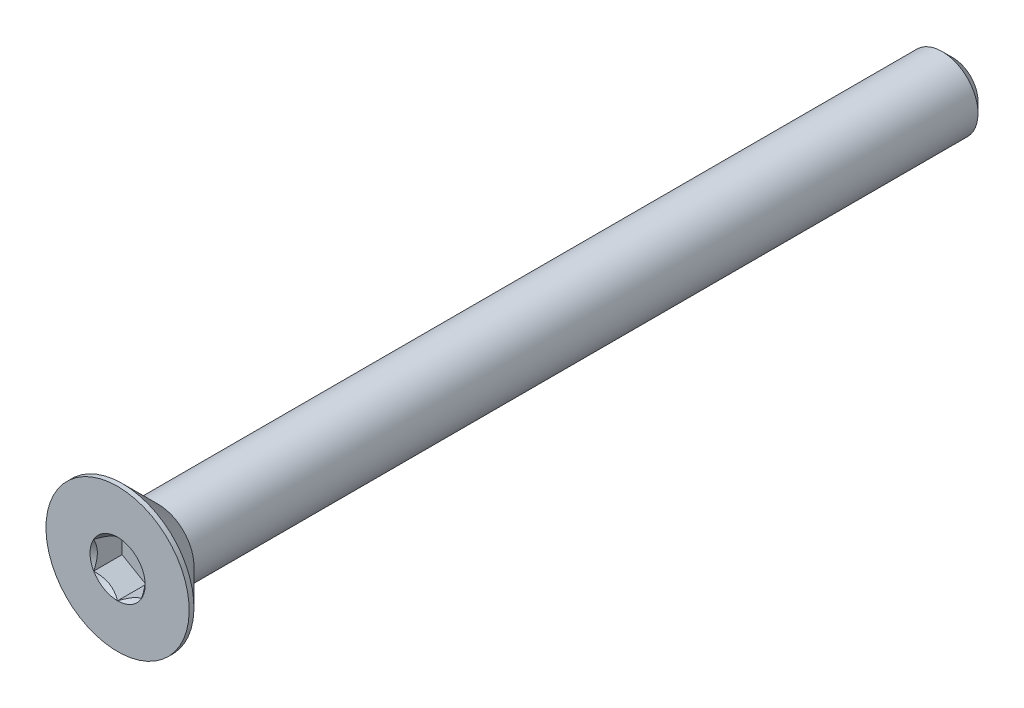
ISO-10303-21;
HEADER;
FILE_DESCRIPTION(('STEP AP214'),'2;1');
FILE_NAME('part.step','',(''),(''),'','','');
FILE_SCHEMA(('AUTOMOTIVE_DESIGN { 1 0 10303 214 1 1 1 1 }'));
ENDSEC;
DATA;
#1=APPLICATION_CONTEXT('core data for automotive mechanical design processes');
#2=APPLICATION_PROTOCOL_DEFINITION('international standard','automotive_design',2000,#1);
#3=PRODUCT_CONTEXT('',#1,'mechanical');
#4=PRODUCT('Part','Part','',(#3));
#5=PRODUCT_RELATED_PRODUCT_CATEGORY('part','',(#4));
#6=PRODUCT_DEFINITION_FORMATION('','',#4);
#7=PRODUCT_DEFINITION_CONTEXT('part definition',#1,'design');
#8=PRODUCT_DEFINITION('design','',#6,#7);
#9=PRODUCT_DEFINITION_SHAPE('','',#8);
#10=(LENGTH_UNIT() NAMED_UNIT(*) SI_UNIT(.MILLI.,.METRE.));
#11=(NAMED_UNIT(*) PLANE_ANGLE_UNIT() SI_UNIT($,.RADIAN.));
#12=(NAMED_UNIT(*) SI_UNIT($,.STERADIAN.) SOLID_ANGLE_UNIT());
#13=UNCERTAINTY_MEASURE_WITH_UNIT(LENGTH_MEASURE(1.E-05),#10,'distance_accuracy_value','');
#14=(GEOMETRIC_REPRESENTATION_CONTEXT(3) GLOBAL_UNCERTAINTY_ASSIGNED_CONTEXT((#13)) GLOBAL_UNIT_ASSIGNED_CONTEXT((#10,
#11,#12)) REPRESENTATION_CONTEXT('',''));
#15=CARTESIAN_POINT('',(0.,0.,0.));
#16=DIRECTION('',(0.,0.,1.));
#17=DIRECTION('',(1.,0.,0.));
#18=AXIS2_PLACEMENT_3D('',#15,#16,#17);
#19=CARTESIAN_POINT('',(0.,0.,-17.5));
#20=DIRECTION('',(0.,0.,-1.));
#21=DIRECTION('',(0.,1.,0.));
#22=AXIS2_PLACEMENT_3D('',#19,#20,#21);
#23=CYLINDRICAL_SURFACE('',#22,1.5);
#24=CARTESIAN_POINT('',(0.,0.,15.8));
#25=DIRECTION('',(0.,0.,-1.));
#26=DIRECTION('',(0.,1.,0.));
#27=AXIS2_PLACEMENT_3D('',#24,#25,#26);
#28=CIRCLE('',#27,1.5);
#29=CARTESIAN_POINT('',(0.,1.5,15.8));
#30=VERTEX_POINT('',#29);
#31=EDGE_CURVE('E11',#30,#30,#28,.F.);
#32=ORIENTED_EDGE('',*,*,#31,.F.);
#33=EDGE_LOOP('',(#32));
#34=FACE_BOUND('',#33,.T.);
#35=CARTESIAN_POINT('',(0.,0.,-17.05));
#36=DIRECTION('',(0.,0.,-1.));
#37=DIRECTION('',(0.,1.,0.));
#38=AXIS2_PLACEMENT_3D('',#35,#36,#37);
#39=CIRCLE('',#38,1.5);
#40=CARTESIAN_POINT('',(0.,1.5,-17.05));
#41=VERTEX_POINT('',#40);
#42=EDGE_CURVE('E50',#41,#41,#39,.F.);
#43=ORIENTED_EDGE('',*,*,#42,.T.);
#44=EDGE_LOOP('',(#43));
#45=FACE_BOUND('',#44,.T.);
#46=ADVANCED_FACE('F41',(#34,#45),#23,.T.);
#47=CARTESIAN_POINT('',(0.,1.5,-17.5));
#48=DIRECTION('',(0.,0.,-1.));
#49=DIRECTION('',(0.,1.,0.));
#50=AXIS2_PLACEMENT_3D('',#47,#48,#49);
#51=PLANE('',#50);
#52=CARTESIAN_POINT('',(0.,0.,-17.5));
#53=DIRECTION('',(0.,0.,-1.));
#54=DIRECTION('',(0.,1.,0.));
#55=AXIS2_PLACEMENT_3D('',#52,#53,#54);
#56=CIRCLE('',#55,1.05000000000001);
#57=CARTESIAN_POINT('',(0.,1.05000000000001,-17.5));
#58=VERTEX_POINT('',#57);
#59=EDGE_CURVE('E166',#58,#58,#56,.T.);
#60=ORIENTED_EDGE('',*,*,#59,.T.);
#61=EDGE_LOOP('',(#60));
#62=FACE_BOUND('',#61,.T.);
#63=ADVANCED_FACE('F177',(#62),#51,.T.);
#64=CARTESIAN_POINT('',(0.,0.,-17.5));
#65=DIRECTION('',(0.,0.,1.));
#66=DIRECTION('',(0.,-1.,0.));
#67=AXIS2_PLACEMENT_3D('',#64,#65,#66);
#68=CONICAL_SURFACE('',#67,1.05000000000001,0.785398163397445);
#69=ORIENTED_EDGE('',*,*,#42,.F.);
#70=EDGE_LOOP('',(#69));
#71=FACE_BOUND('',#70,.T.);
#72=ORIENTED_EDGE('',*,*,#59,.F.);
#73=EDGE_LOOP('',(#72));
#74=FACE_BOUND('',#73,.T.);
#75=ADVANCED_FACE('F43',(#71,#74),#68,.T.);
#76=CARTESIAN_POINT('',(0.,0.,-17.5));
#77=DIRECTION('',(0.,0.,-1.));
#78=DIRECTION('',(0.,1.,0.));
#79=AXIS2_PLACEMENT_3D('',#76,#77,#78);
#80=CYLINDRICAL_SURFACE('',#79,3.);
#81=CARTESIAN_POINT('',(0.,0.,17.5));
#82=DIRECTION('',(0.,0.,-1.));
#83=DIRECTION('',(0.,1.,0.));
#84=AXIS2_PLACEMENT_3D('',#81,#82,#83);
#85=CIRCLE('',#84,3.);
#86=CARTESIAN_POINT('',(0.,3.,17.5));
#87=VERTEX_POINT('',#86);
#88=EDGE_CURVE('E141',#87,#87,#85,.T.);
#89=ORIENTED_EDGE('',*,*,#88,.T.);
#90=EDGE_LOOP('',(#89));
#91=FACE_BOUND('',#90,.T.);
#92=CARTESIAN_POINT('',(0.,0.,17.3));
#93=DIRECTION('',(0.,0.,-1.));
#94=DIRECTION('',(0.,1.,0.));
#95=AXIS2_PLACEMENT_3D('',#92,#93,#94);
#96=CIRCLE('',#95,3.);
#97=CARTESIAN_POINT('',(0.,3.,17.3));
#98=VERTEX_POINT('',#97);
#99=EDGE_CURVE('E136',#98,#98,#96,.T.);
#100=ORIENTED_EDGE('',*,*,#99,.F.);
#101=EDGE_LOOP('',(#100));
#102=FACE_BOUND('',#101,.T.);
#103=ADVANCED_FACE('F176',(#91,#102),#80,.T.);
#104=CARTESIAN_POINT('',(0.,0.,15.8));
#105=DIRECTION('',(0.,0.,1.));
#106=DIRECTION('',(0.,-1.,0.));
#107=AXIS2_PLACEMENT_3D('',#104,#105,#106);
#108=CONICAL_SURFACE('',#107,1.5,0.78539816339745);
#109=ORIENTED_EDGE('',*,*,#99,.T.);
#110=EDGE_LOOP('',(#109));
#111=FACE_BOUND('',#110,.T.);
#112=ORIENTED_EDGE('',*,*,#31,.T.);
#113=EDGE_LOOP('',(#112));
#114=FACE_BOUND('',#113,.T.);
#115=ADVANCED_FACE('F190',(#111,#114),#108,.T.);
#116=CARTESIAN_POINT('',(0.,0.,17.5));
#117=DIRECTION('',(0.,0.,1.));
#118=DIRECTION('',(0.,-1.,0.));
#119=AXIS2_PLACEMENT_3D('',#116,#117,#118);
#120=PLANE('',#119);
#121=CARTESIAN_POINT('',(0.,0.,17.5));
#122=DIRECTION('',(0.,0.,1.));
#123=DIRECTION('',(1.,0.,0.));
#124=AXIS2_PLACEMENT_3D('',#121,#122,#123);
#125=CIRCLE('',#124,1.15470053837925);
#126=CARTESIAN_POINT('',(1.,0.577350269189628,17.5));
#127=VERTEX_POINT('',#126);
#128=CARTESIAN_POINT('',(0.,1.15470053837926,17.5));
#129=VERTEX_POINT('',#128);
#130=EDGE_CURVE('E101',#127,#129,#125,.T.);
#131=ORIENTED_EDGE('',*,*,#130,.F.);
#132=CARTESIAN_POINT('',(0.,0.,17.5));
#133=DIRECTION('',(0.,0.,1.));
#134=DIRECTION('',(1.,0.,0.));
#135=AXIS2_PLACEMENT_3D('',#132,#133,#134);
#136=CIRCLE('',#135,1.15470053837925);
#137=CARTESIAN_POINT('',(0.999999999999989,-0.577350269189633,17.5));
#138=VERTEX_POINT('',#137);
#139=EDGE_CURVE('E114',#138,#127,#136,.T.);
#140=ORIENTED_EDGE('',*,*,#139,.F.);
#141=CARTESIAN_POINT('',(0.,0.,17.5));
#142=DIRECTION('',(0.,0.,1.));
#143=DIRECTION('',(1.,0.,0.));
#144=AXIS2_PLACEMENT_3D('',#141,#142,#143);
#145=CIRCLE('',#144,1.15470053837925);
#146=CARTESIAN_POINT('',(0.,-1.15470053837924,17.5));
#147=VERTEX_POINT('',#146);
#148=EDGE_CURVE('E270',#147,#138,#145,.T.);
#149=ORIENTED_EDGE('',*,*,#148,.F.);
#150=CARTESIAN_POINT('',(0.,0.,17.5));
#151=DIRECTION('',(0.,0.,1.));
#152=DIRECTION('',(1.,0.,0.));
#153=AXIS2_PLACEMENT_3D('',#150,#151,#152);
#154=CIRCLE('',#153,1.15470053837925);
#155=CARTESIAN_POINT('',(-1.,-0.577350269189614,17.5));
#156=VERTEX_POINT('',#155);
#157=EDGE_CURVE('E130',#156,#147,#154,.T.);
#158=ORIENTED_EDGE('',*,*,#157,.F.);
#159=CARTESIAN_POINT('',(0.,0.,17.5));
#160=DIRECTION('',(0.,0.,1.));
#161=DIRECTION('',(1.,0.,0.));
#162=AXIS2_PLACEMENT_3D('',#159,#160,#161);
#163=CIRCLE('',#162,1.15470053837925);
#164=CARTESIAN_POINT('',(-1.,0.577350269189626,17.5));
#165=VERTEX_POINT('',#164);
#166=EDGE_CURVE('E271',#165,#156,#163,.T.);
#167=ORIENTED_EDGE('',*,*,#166,.F.);
#168=CARTESIAN_POINT('',(0.,0.,17.5));
#169=DIRECTION('',(0.,0.,1.));
#170=DIRECTION('',(1.,0.,0.));
#171=AXIS2_PLACEMENT_3D('',#168,#169,#170);
#172=CIRCLE('',#171,1.15470053837925);
#173=EDGE_CURVE('E117',#129,#165,#172,.T.);
#174=ORIENTED_EDGE('',*,*,#173,.F.);
#175=EDGE_LOOP('',(#131,#140,#149,#158,#167,#174));
#176=FACE_BOUND('',#175,.T.);
#177=ORIENTED_EDGE('',*,*,#88,.F.);
#178=EDGE_LOOP('',(#177));
#179=FACE_BOUND('',#178,.T.);
#180=ADVANCED_FACE('F111',(#176,#179),#120,.T.);
#181=CARTESIAN_POINT('',(1.,0.577350269189626,16.31));
#182=DIRECTION('',(0.5,0.866025403784438,0.));
#183=DIRECTION('',(-0.866025403784439,0.5,0.));
#184=AXIS2_PLACEMENT_3D('',#181,#182,#183);
#185=PLANE('',#184);
#186=DIRECTION('',(0.,0.,1.));
#187=VECTOR('',#186,1.);
#188=CARTESIAN_POINT('',(1.,0.577350269189626,16.31));
#189=LINE('',#188,#187);
#190=CARTESIAN_POINT('',(1.,0.577350269189626,16.31));
#191=VERTEX_POINT('',#190);
#192=EDGE_CURVE('E57',#191,#127,#189,.T.);
#193=ORIENTED_EDGE('',*,*,#192,.T.);
#194=CARTESIAN_POINT('',(-0.000199999999999633,1.15481600843309,17.5001154873726));
#195=CARTESIAN_POINT('',(0.0341825950071806,1.13496520795026,17.4802779308257));
#196=CARTESIAN_POINT('',(0.0691401181398251,1.11478247255942,17.4616050206389));
#197=CARTESIAN_POINT('',(0.14042280295609,1.07362739529219,17.4274147427232));
#198=CARTESIAN_POINT('',(0.176754750528985,1.0526511355808,17.4119164090235));
#199=CARTESIAN_POINT('',(0.250016613803312,1.01035337909803,17.3853673071423));
#200=CARTESIAN_POINT('',(0.286927851445415,0.989042666109241,17.3742497739969));
#201=CARTESIAN_POINT('',(0.361562729310859,0.945952199282692,17.3571198657762));
#202=CARTESIAN_POINT('',(0.399284088108636,0.924173762626597,17.3510946974667));
#203=CARTESIAN_POINT('',(0.464292198417933,0.886641312640015,17.3456605549675));
#204=CARTESIAN_POINT('',(0.491494371528172,0.870936130672276,17.3448569383167));
#205=CARTESIAN_POINT('',(0.545846040669111,0.839556179862849,17.3462066994169));
#206=CARTESIAN_POINT('',(0.572995523754875,0.823881418494925,17.3483607295472));
#207=CARTESIAN_POINT('',(0.654056277326959,0.777080970599368,17.3591169721285));
#208=CARTESIAN_POINT('',(0.707564140978426,0.746188191116432,17.3720145564154));
#209=CARTESIAN_POINT('',(0.80147606514343,0.691968116419651,17.4031407306022));
#210=CARTESIAN_POINT('',(0.842320523671833,0.668386557293373,17.4197377977018));
#211=CARTESIAN_POINT('',(0.922409637381942,0.622147085933683,17.4571249246853));
#212=CARTESIAN_POINT('',(0.961659010870437,0.599486449584576,17.4779013418174));
#213=CARTESIAN_POINT('',(1.0002,0.577234799135789,17.5001154873726));
#214=B_SPLINE_CURVE_WITH_KNOTS('',3,(#194,#195,#196,#197,#198,#199,#200,#201,#202,#203,#204,
#205,#206,#207,#208,#209,#210,#211,#212,#213),.UNSPECIFIED.,.F.,.F.,(4,2,2,2,2,2,2,2,2,4),(0.,
0.13323767682856,0.26725222983449,0.399137076269299,0.530689603280767,0.624814864263845,
0.718960890149131,0.907306626112095,1.05710100361789,1.20641411519286),.UNSPECIFIED.);
#215=EDGE_CURVE('E98',#129,#127,#214,.T.);
#216=ORIENTED_EDGE('',*,*,#215,.F.);
#217=DIRECTION('',(0.,0.,1.));
#218=VECTOR('',#217,1.);
#219=CARTESIAN_POINT('',(0.,1.15470053837925,16.31));
#220=LINE('',#219,#218);
#221=CARTESIAN_POINT('',(0.,1.15470053837925,16.31));
#222=VERTEX_POINT('',#221);
#223=EDGE_CURVE('E160',#222,#129,#220,.T.);
#224=ORIENTED_EDGE('',*,*,#223,.F.);
#225=DIRECTION('',(-0.866025403784439,0.5,0.));
#226=VECTOR('',#225,1.);
#227=CARTESIAN_POINT('',(1.,0.577350269189626,16.31));
#228=LINE('',#227,#226);
#229=EDGE_CURVE('E126',#191,#222,#228,.T.);
#230=ORIENTED_EDGE('',*,*,#229,.F.);
#231=EDGE_LOOP('',(#193,#216,#224,#230));
#232=FACE_BOUND('',#231,.T.);
#233=ADVANCED_FACE('F132',(#232),#185,.F.);
#234=CARTESIAN_POINT('',(1.,-0.577350269189627,16.31));
#235=DIRECTION('',(1.,0.,0.));
#236=DIRECTION('',(0.,0.,-1.));
#237=AXIS2_PLACEMENT_3D('',#234,#235,#236);
#238=PLANE('',#237);
#239=DIRECTION('',(0.,0.,1.));
#240=VECTOR('',#239,1.);
#241=CARTESIAN_POINT('',(1.,-0.577350269189627,16.31));
#242=LINE('',#241,#240);
#243=CARTESIAN_POINT('',(1.,-0.577350269189627,16.31));
#244=VERTEX_POINT('',#243);
#245=EDGE_CURVE('E65',#244,#138,#242,.T.);
#246=ORIENTED_EDGE('',*,*,#245,.T.);
#247=CARTESIAN_POINT('',(1.,-1.15147208646462,17.8703856775139));
#248=CARTESIAN_POINT('',(1.,-1.12343447988552,17.8492199198737));
#249=CARTESIAN_POINT('',(1.,-1.09524064850698,17.8282616921759));
#250=CARTESIAN_POINT('',(1.,-1.03847715644376,17.7868460222356));
#251=CARTESIAN_POINT('',(1.,-1.00990740382975,17.7663887061237));
#252=CARTESIAN_POINT('',(1.,-0.923120894333477,17.7056047949545));
#253=CARTESIAN_POINT('',(1.,-0.864253173759061,17.6661922289614));
#254=CARTESIAN_POINT('',(1.,-0.740809858258046,17.5888206642002));
#255=CARTESIAN_POINT('',(1.,-0.676100255137807,17.5510730391143));
#256=CARTESIAN_POINT('',(1.,-0.543448939049123,17.4820245875513));
#257=CARTESIAN_POINT('',(1.,-0.475519112027777,17.4507020278469));
#258=CARTESIAN_POINT('',(1.,-0.373555850333527,17.4123817788838));
#259=CARTESIAN_POINT('',(1.,-0.341031989670906,17.4013835916422));
#260=CARTESIAN_POINT('',(1.,-0.275199079052292,17.3819983421474));
#261=CARTESIAN_POINT('',(1.,-0.241889975173932,17.3736114597767));
#262=CARTESIAN_POINT('',(1.,-0.175247517042991,17.360025220719));
#263=CARTESIAN_POINT('',(1.,-0.141925568218174,17.354770790768));
#264=CARTESIAN_POINT('',(1.,-0.0749144362322776,17.3475486865709));
#265=CARTESIAN_POINT('',(1.,-0.0412251978501605,17.3455815136105));
#266=CARTESIAN_POINT('',(1.,0.0249580992634226,17.3450831983932));
#267=CARTESIAN_POINT('',(1.,0.0574512826460412,17.3464302678886));
#268=CARTESIAN_POINT('',(1.,0.122148505701869,17.352216484499));
#269=CARTESIAN_POINT('',(1.,0.154352610132929,17.3566549206615));
#270=CARTESIAN_POINT('',(1.,0.218799898867643,17.3684568301452));
#271=CARTESIAN_POINT('',(1.,0.251033743268957,17.3758705410385));
#272=CARTESIAN_POINT('',(1.,0.314797132354923,17.3932289424987));
#273=CARTESIAN_POINT('',(1.,0.346326735731009,17.4031734212888));
#274=CARTESIAN_POINT('',(1.,0.445594187730208,17.4382234825543));
#275=CARTESIAN_POINT('',(1.,0.511919139476038,17.4673208583567));
#276=CARTESIAN_POINT('',(1.,0.641453244657532,17.5320153296865));
#277=CARTESIAN_POINT('',(1.,0.704650133126345,17.5676357767152));
#278=CARTESIAN_POINT('',(1.,0.825428490174988,17.6411239013469));
#279=CARTESIAN_POINT('',(1.,0.883132947867687,17.6787919471355));
#280=CARTESIAN_POINT('',(1.,0.968148853704567,17.7370228529432));
#281=CARTESIAN_POINT('',(1.,0.996120570380286,17.7566384757629));
#282=CARTESIAN_POINT('',(1.,1.05168177729902,17.7963885170613));
#283=CARTESIAN_POINT('',(1.,1.079271369977,17.8165227921988));
#284=CARTESIAN_POINT('',(1.,1.10670185346329,17.836872119073));
#285=B_SPLINE_CURVE_WITH_KNOTS('',3,(#247,#248,#249,#250,#251,#252,#253,#254,#255,#256,#257,
#258,#259,#260,#261,#262,#263,#264,#265,#266,#267,#268,#269,#270,#271,#272,#273,#274,#275,#276,
#277,#278,#279,#280,#281,#282,#283,#284),.UNSPECIFIED.,.F.,.F.,(4,2,2,2,2,2,2,2,2,2,2,2,2,2,2,2,
2,2,4),(0.,0.105386459083293,0.210799187330127,0.423233611565473,0.647793540908512,
0.871580877738619,0.974493074181429,1.07741235827202,1.17846428203205,1.27953161415763,
1.37694086739611,1.47432772585409,1.57343322804294,1.67253043972852,1.88917353996828,
2.10660791038814,2.31323734249844,2.41572589232045,2.51818641476504),.UNSPECIFIED.);
#286=EDGE_CURVE('E124',#127,#138,#285,.F.);
#287=ORIENTED_EDGE('',*,*,#286,.F.);
#288=ORIENTED_EDGE('',*,*,#192,.F.);
#289=DIRECTION('',(0.,1.,0.));
#290=VECTOR('',#289,1.);
#291=CARTESIAN_POINT('',(1.,-0.577350269189627,16.31));
#292=LINE('',#291,#290);
#293=EDGE_CURVE('E146',#244,#191,#292,.T.);
#294=ORIENTED_EDGE('',*,*,#293,.F.);
#295=EDGE_LOOP('',(#246,#287,#288,#294));
#296=FACE_BOUND('',#295,.T.);
#297=ADVANCED_FACE('F128',(#296),#238,.F.);
#298=CARTESIAN_POINT('',(0.,-1.15470053837925,16.31));
#299=DIRECTION('',(0.5,-0.866025403784439,0.));
#300=DIRECTION('',(0.866025403784439,0.5,0.));
#301=AXIS2_PLACEMENT_3D('',#298,#299,#300);
#302=PLANE('',#301);
#303=DIRECTION('',(0.,0.,1.));
#304=VECTOR('',#303,1.);
#305=CARTESIAN_POINT('',(0.,-1.15470053837925,16.31));
#306=LINE('',#305,#304);
#307=CARTESIAN_POINT('',(0.,-1.15470053837925,16.31));
#308=VERTEX_POINT('',#307);
#309=EDGE_CURVE('E143',#308,#147,#306,.T.);
#310=ORIENTED_EDGE('',*,*,#309,.T.);
#311=CARTESIAN_POINT('',(1.0002,-0.577234799135789,17.5001154873726));
#312=CARTESIAN_POINT('',(0.965817404992819,-0.597085599618622,17.4802779308257));
#313=CARTESIAN_POINT('',(0.930859881860175,-0.617268335009457,17.4616050206389));
#314=CARTESIAN_POINT('',(0.85957719704391,-0.658423412276686,17.4274147427232));
#315=CARTESIAN_POINT('',(0.823245249471016,-0.67939967198808,17.4119164090235));
#316=CARTESIAN_POINT('',(0.749983386196689,-0.721697428470847,17.3853673071423));
#317=CARTESIAN_POINT('',(0.713072148554586,-0.743008141459637,17.3742497739969));
#318=CARTESIAN_POINT('',(0.638437270689141,-0.786098608286186,17.3571198657762));
#319=CARTESIAN_POINT('',(0.600715911891365,-0.807877044942281,17.3510946974667));
#320=CARTESIAN_POINT('',(0.535707801582067,-0.845409494928863,17.3456605549675));
#321=CARTESIAN_POINT('',(0.508505628471829,-0.861114676896602,17.3448569383167));
#322=CARTESIAN_POINT('',(0.454153959330889,-0.892494627706029,17.3462066994169));
#323=CARTESIAN_POINT('',(0.427004476245125,-0.908169389073954,17.3483607295472));
#324=CARTESIAN_POINT('',(0.345943722673039,-0.954969836969511,17.3591169721285));
#325=CARTESIAN_POINT('',(0.292435859021572,-0.985862616452448,17.3720145564154));
#326=CARTESIAN_POINT('',(0.198523934856567,-1.04008269114923,17.4031407306022));
#327=CARTESIAN_POINT('',(0.157679476328164,-1.06366425027551,17.4197377977019));
#328=CARTESIAN_POINT('',(0.0775903626180554,-1.1099037216352,17.4571249246853));
#329=CARTESIAN_POINT('',(0.0383409891295619,-1.1325643579843,17.4779013418174));
#330=CARTESIAN_POINT('',(-0.000199999999999786,-1.15481600843309,17.5001154873726));
#331=B_SPLINE_CURVE_WITH_KNOTS('',3,(#311,#312,#313,#314,#315,#316,#317,#318,#319,#320,#321,
#322,#323,#324,#325,#326,#327,#328,#329,#330),.UNSPECIFIED.,.F.,.F.,(4,2,2,2,2,2,2,2,2,4),(0.,
0.133237676828558,0.267252229834489,0.399137076269298,0.530689603280766,0.624814864263844,
0.718960890149131,0.907306626112098,1.0571010036179,1.20641411519286),.UNSPECIFIED.);
#332=EDGE_CURVE('E267',#138,#147,#331,.T.);
#333=ORIENTED_EDGE('',*,*,#332,.F.);
#334=ORIENTED_EDGE('',*,*,#245,.F.);
#335=DIRECTION('',(0.866025403784439,0.5,0.));
#336=VECTOR('',#335,1.);
#337=CARTESIAN_POINT('',(0.,-1.15470053837925,16.31));
#338=LINE('',#337,#336);
#339=EDGE_CURVE('E257',#308,#244,#338,.T.);
#340=ORIENTED_EDGE('',*,*,#339,.F.);
#341=EDGE_LOOP('',(#310,#333,#334,#340));
#342=FACE_BOUND('',#341,.T.);
#343=ADVANCED_FACE('F216',(#342),#302,.F.);
#344=CARTESIAN_POINT('',(-1.,-0.577350269189626,16.31));
#345=DIRECTION('',(-0.5,-0.866025403784439,0.));
#346=DIRECTION('',(0.866025403784439,-0.5,0.));
#347=AXIS2_PLACEMENT_3D('',#344,#345,#346);
#348=PLANE('',#347);
#349=DIRECTION('',(0.,0.,1.));
#350=VECTOR('',#349,1.);
#351=CARTESIAN_POINT('',(-1.,-0.577350269189626,16.31));
#352=LINE('',#351,#350);
#353=CARTESIAN_POINT('',(-1.,-0.577350269189626,16.31));
#354=VERTEX_POINT('',#353);
#355=EDGE_CURVE('E152',#354,#156,#352,.T.);
#356=ORIENTED_EDGE('',*,*,#355,.T.);
#357=CARTESIAN_POINT('',(0.000199999999999887,-1.15481600843309,17.5001154873726));
#358=CARTESIAN_POINT('',(-0.0341825950071802,-1.13496520795026,17.4802779308257));
#359=CARTESIAN_POINT('',(-0.0691401181398246,-1.11478247255942,17.4616050206389));
#360=CARTESIAN_POINT('',(-0.14042280295609,-1.07362739529219,17.4274147427232));
#361=CARTESIAN_POINT('',(-0.176754750528984,-1.0526511355808,17.4119164090235));
#362=CARTESIAN_POINT('',(-0.250016613803311,-1.01035337909803,17.3853673071423));
#363=CARTESIAN_POINT('',(-0.286927851445414,-0.989042666109241,17.3742497739969));
#364=CARTESIAN_POINT('',(-0.361562729310858,-0.945952199282692,17.3571198657762));
#365=CARTESIAN_POINT('',(-0.399284088108635,-0.924173762626597,17.3510946974667));
#366=CARTESIAN_POINT('',(-0.464292198417932,-0.886641312640015,17.3456605549675));
#367=CARTESIAN_POINT('',(-0.491494371528171,-0.870936130672276,17.3448569383167));
#368=CARTESIAN_POINT('',(-0.545846040669111,-0.839556179862849,17.3462066994169));
#369=CARTESIAN_POINT('',(-0.572995523754875,-0.823881418494924,17.3483607295472));
#370=CARTESIAN_POINT('',(-0.65405627732696,-0.777080970599367,17.3591169721285));
#371=CARTESIAN_POINT('',(-0.707564140978428,-0.74618819111643,17.3720145564154));
#372=CARTESIAN_POINT('',(-0.801476065143432,-0.691968116419649,17.4031407306022));
#373=CARTESIAN_POINT('',(-0.842320523671834,-0.668386557293372,17.4197377977018));
#374=CARTESIAN_POINT('',(-0.922409637381943,-0.622147085933682,17.4571249246853));
#375=CARTESIAN_POINT('',(-0.961659010870437,-0.599486449584576,17.4779013418174));
#376=CARTESIAN_POINT('',(-1.0002,-0.577234799135788,17.5001154873726));
#377=B_SPLINE_CURVE_WITH_KNOTS('',3,(#357,#358,#359,#360,#361,#362,#363,#364,#365,#366,#367,
#368,#369,#370,#371,#372,#373,#374,#375,#376),.UNSPECIFIED.,.F.,.F.,(4,2,2,2,2,2,2,2,2,4),(0.,
0.13323767682856,0.267252229834489,0.399137076269298,0.530689603280766,0.624814864263845,
0.718960890149132,0.907306626112097,1.05710100361789,1.20641411519286),.UNSPECIFIED.);
#378=EDGE_CURVE('E233',#147,#156,#377,.T.);
#379=ORIENTED_EDGE('',*,*,#378,.F.);
#380=ORIENTED_EDGE('',*,*,#309,.F.);
#381=DIRECTION('',(0.866025403784439,-0.5,0.));
#382=VECTOR('',#381,1.);
#383=CARTESIAN_POINT('',(-1.,-0.577350269189626,16.31));
#384=LINE('',#383,#382);
#385=EDGE_CURVE('E254',#354,#308,#384,.T.);
#386=ORIENTED_EDGE('',*,*,#385,.F.);
#387=EDGE_LOOP('',(#356,#379,#380,#386));
#388=FACE_BOUND('',#387,.T.);
#389=ADVANCED_FACE('F212',(#388),#348,.F.);
#390=CARTESIAN_POINT('',(-1.,0.577350269189626,16.31));
#391=DIRECTION('',(-1.,0.,0.));
#392=DIRECTION('',(0.,-1.,0.));
#393=AXIS2_PLACEMENT_3D('',#390,#391,#392);
#394=PLANE('',#393);
#395=DIRECTION('',(0.,0.,1.));
#396=VECTOR('',#395,1.);
#397=CARTESIAN_POINT('',(-1.,0.577350269189626,16.31));
#398=LINE('',#397,#396);
#399=CARTESIAN_POINT('',(-1.,0.577350269189626,16.31));
#400=VERTEX_POINT('',#399);
#401=EDGE_CURVE('E156',#400,#165,#398,.T.);
#402=ORIENTED_EDGE('',*,*,#401,.T.);
#403=CARTESIAN_POINT('',(-1.,-1.15147208646462,17.8703856775139));
#404=CARTESIAN_POINT('',(-1.,-1.12343447988552,17.8492199198737));
#405=CARTESIAN_POINT('',(-1.,-1.09524064850697,17.8282616921759));
#406=CARTESIAN_POINT('',(-1.,-1.03847715644377,17.7868460222356));
#407=CARTESIAN_POINT('',(-1.,-1.00990740382975,17.7663887061237));
#408=CARTESIAN_POINT('',(-1.,-0.92312089433348,17.7056047949545));
#409=CARTESIAN_POINT('',(-1.,-0.864253173759061,17.6661922289614));
#410=CARTESIAN_POINT('',(-1.,-0.740809858258045,17.5888206642002));
#411=CARTESIAN_POINT('',(-1.,-0.676100255137806,17.5510730391143));
#412=CARTESIAN_POINT('',(-1.,-0.543448939049123,17.4820245875513));
#413=CARTESIAN_POINT('',(-1.,-0.475519112027777,17.4507020278469));
#414=CARTESIAN_POINT('',(-1.,-0.373555850333526,17.4123817788838));
#415=CARTESIAN_POINT('',(-1.,-0.341031989670905,17.4013835916422));
#416=CARTESIAN_POINT('',(-1.,-0.27519907905229,17.3819983421474));
#417=CARTESIAN_POINT('',(-1.,-0.24188997517393,17.3736114597767));
#418=CARTESIAN_POINT('',(-1.,-0.175247517042989,17.360025220719));
#419=CARTESIAN_POINT('',(-1.,-0.141925568218171,17.354770790768));
#420=CARTESIAN_POINT('',(-1.,-0.0749144362322752,17.3475486865709));
#421=CARTESIAN_POINT('',(-1.,-0.0412251978501579,17.3455815136105));
#422=CARTESIAN_POINT('',(-1.,0.0249580992634252,17.3450831983932));
#423=CARTESIAN_POINT('',(-1.,0.0574512826460438,17.3464302678886));
#424=CARTESIAN_POINT('',(-1.,0.122148505701872,17.352216484499));
#425=CARTESIAN_POINT('',(-1.,0.154352610132932,17.3566549206615));
#426=CARTESIAN_POINT('',(-1.,0.218799898867645,17.3684568301452));
#427=CARTESIAN_POINT('',(-1.,0.251033743268959,17.3758705410385));
#428=CARTESIAN_POINT('',(-1.,0.314797132354925,17.3932289424987));
#429=CARTESIAN_POINT('',(-1.,0.346326735731011,17.4031734212888));
#430=CARTESIAN_POINT('',(-1.,0.445594187730211,17.4382234825543));
#431=CARTESIAN_POINT('',(-1.,0.511919139476043,17.4673208583567));
#432=CARTESIAN_POINT('',(-1.,0.64145324465754,17.5320153296865));
#433=CARTESIAN_POINT('',(-1.,0.704650133126352,17.5676357767152));
#434=CARTESIAN_POINT('',(-1.,0.825428490174993,17.6411239013469));
#435=CARTESIAN_POINT('',(-1.,0.883132947867691,17.6787919471355));
#436=CARTESIAN_POINT('',(-1.,0.968148853704571,17.7370228529432));
#437=CARTESIAN_POINT('',(-1.,0.996120570380291,17.7566384757629));
#438=CARTESIAN_POINT('',(-1.,1.05168177729902,17.7963885170613));
#439=CARTESIAN_POINT('',(-1.,1.07927136997701,17.8165227921988));
#440=CARTESIAN_POINT('',(-1.,1.1067018534633,17.836872119073));
#441=B_SPLINE_CURVE_WITH_KNOTS('',3,(#403,#404,#405,#406,#407,#408,#409,#410,#411,#412,#413,
#414,#415,#416,#417,#418,#419,#420,#421,#422,#423,#424,#425,#426,#427,#428,#429,#430,#431,#432,
#433,#434,#435,#436,#437,#438,#439,#440),.UNSPECIFIED.,.F.,.F.,(4,2,2,2,2,2,2,2,2,2,2,2,2,2,2,2,
2,2,4),(0.,0.10538645908329,0.210799187330125,0.423233611565473,0.647793540908509,
0.871580877738619,0.974493074181429,1.07741235827202,1.17846428203206,1.27953161415763,
1.37694086739611,1.47432772585409,1.57343322804294,1.67253043972853,1.88917353996828,
2.10660791038814,2.31323734249845,2.41572589232045,2.51818641476504),.UNSPECIFIED.);
#442=EDGE_CURVE('E105',#156,#165,#441,.T.);
#443=ORIENTED_EDGE('',*,*,#442,.F.);
#444=ORIENTED_EDGE('',*,*,#355,.F.);
#445=DIRECTION('',(0.,-1.,0.));
#446=VECTOR('',#445,1.);
#447=CARTESIAN_POINT('',(-1.,0.577350269189626,16.31));
#448=LINE('',#447,#446);
#449=EDGE_CURVE('E250',#400,#354,#448,.T.);
#450=ORIENTED_EDGE('',*,*,#449,.F.);
#451=EDGE_LOOP('',(#402,#443,#444,#450));
#452=FACE_BOUND('',#451,.T.);
#453=ADVANCED_FACE('F208',(#452),#394,.F.);
#454=CARTESIAN_POINT('',(0.,1.15470053837925,16.31));
#455=DIRECTION('',(-0.5,0.866025403784439,0.));
#456=DIRECTION('',(-0.866025403784439,-0.5,0.));
#457=AXIS2_PLACEMENT_3D('',#454,#455,#456);
#458=PLANE('',#457);
#459=ORIENTED_EDGE('',*,*,#223,.T.);
#460=CARTESIAN_POINT('',(-1.0002,0.577234799135788,17.5001154873726));
#461=CARTESIAN_POINT('',(-0.965817404992819,0.597085599618622,17.4802779308257));
#462=CARTESIAN_POINT('',(-0.930859881860175,0.617268335009457,17.4616050206389));
#463=CARTESIAN_POINT('',(-0.859577197043909,0.658423412276687,17.4274147427232));
#464=CARTESIAN_POINT('',(-0.823245249471014,0.679399671988081,17.4119164090235));
#465=CARTESIAN_POINT('',(-0.749983386196687,0.721697428470848,17.3853673071423));
#466=CARTESIAN_POINT('',(-0.713072148554584,0.743008141459638,17.3742497739969));
#467=CARTESIAN_POINT('',(-0.63843727068914,0.786098608286187,17.3571198657762));
#468=CARTESIAN_POINT('',(-0.600715911891363,0.807877044942282,17.3510946974667));
#469=CARTESIAN_POINT('',(-0.535707801582066,0.845409494928864,17.3456605549675));
#470=CARTESIAN_POINT('',(-0.508505628471827,0.861114676896603,17.3448569383167));
#471=CARTESIAN_POINT('',(-0.454153959330888,0.89249462770603,17.3462066994169));
#472=CARTESIAN_POINT('',(-0.427004476245124,0.908169389073954,17.3483607295472));
#473=CARTESIAN_POINT('',(-0.34594372267304,0.954969836969511,17.3591169721285));
#474=CARTESIAN_POINT('',(-0.292435859021573,0.985862616452447,17.3720145564154));
#475=CARTESIAN_POINT('',(-0.19852393485657,1.04008269114923,17.4031407306022));
#476=CARTESIAN_POINT('',(-0.157679476328167,1.06366425027551,17.4197377977018));
#477=CARTESIAN_POINT('',(-0.0775903626180568,1.1099037216352,17.4571249246853));
#478=CARTESIAN_POINT('',(-0.0383409891295623,1.1325643579843,17.4779013418174));
#479=CARTESIAN_POINT('',(0.000199999999999727,1.15481600843309,17.5001154873726));
#480=B_SPLINE_CURVE_WITH_KNOTS('',3,(#460,#461,#462,#463,#464,#465,#466,#467,#468,#469,#470,
#471,#472,#473,#474,#475,#476,#477,#478,#479),.UNSPECIFIED.,.F.,.F.,(4,2,2,2,2,2,2,2,2,4),(0.,
0.13323767682856,0.267252229834493,0.399137076269302,0.53068960328077,0.624814864263847,
0.718960890149133,0.907306626112097,1.05710100361789,1.20641411519286),.UNSPECIFIED.);
#481=EDGE_CURVE('E263',#165,#129,#480,.T.);
#482=ORIENTED_EDGE('',*,*,#481,.F.);
#483=ORIENTED_EDGE('',*,*,#401,.F.);
#484=DIRECTION('',(-0.866025403784439,-0.5,0.));
#485=VECTOR('',#484,1.);
#486=CARTESIAN_POINT('',(0.,1.15470053837925,16.31));
#487=LINE('',#486,#485);
#488=EDGE_CURVE('E246',#222,#400,#487,.T.);
#489=ORIENTED_EDGE('',*,*,#488,.F.);
#490=EDGE_LOOP('',(#459,#482,#483,#489));
#491=FACE_BOUND('',#490,.T.);
#492=ADVANCED_FACE('F204',(#491),#458,.F.);
#493=CARTESIAN_POINT('',(0.,0.,16.31));
#494=DIRECTION('',(0.,0.,1.));
#495=DIRECTION('',(1.,0.,0.));
#496=AXIS2_PLACEMENT_3D('',#493,#494,#495);
#497=PLANE('',#496);
#498=ORIENTED_EDGE('',*,*,#229,.T.);
#499=ORIENTED_EDGE('',*,*,#488,.T.);
#500=ORIENTED_EDGE('',*,*,#449,.T.);
#501=ORIENTED_EDGE('',*,*,#385,.T.);
#502=ORIENTED_EDGE('',*,*,#339,.T.);
#503=ORIENTED_EDGE('',*,*,#293,.T.);
#504=EDGE_LOOP('',(#498,#499,#500,#501,#502,#503));
#505=FACE_BOUND('',#504,.T.);
#506=ADVANCED_FACE('F207',(#505),#497,.T.);
#507=CARTESIAN_POINT('',(0.,0.,17.5));
#508=DIRECTION('',(0.,0.,1.));
#509=DIRECTION('',(1.,0.,0.));
#510=AXIS2_PLACEMENT_3D('',#507,#508,#509);
#511=CONICAL_SURFACE('',#510,1.15470053837925,0.78539816339745);
#512=ORIENTED_EDGE('',*,*,#481,.T.);
#513=ORIENTED_EDGE('',*,*,#173,.T.);
#514=EDGE_LOOP('',(#512,#513));
#515=FACE_BOUND('',#514,.T.);
#516=ADVANCED_FACE('F223',(#515),#511,.F.);
#517=CARTESIAN_POINT('',(0.,0.,17.5));
#518=DIRECTION('',(0.,0.,1.));
#519=DIRECTION('',(1.,0.,0.));
#520=AXIS2_PLACEMENT_3D('',#517,#518,#519);
#521=CONICAL_SURFACE('',#520,1.15470053837925,0.78539816339745);
#522=ORIENTED_EDGE('',*,*,#378,.T.);
#523=ORIENTED_EDGE('',*,*,#157,.T.);
#524=EDGE_LOOP('',(#522,#523));
#525=FACE_BOUND('',#524,.T.);
#526=ADVANCED_FACE('F225',(#525),#521,.F.);
#527=CARTESIAN_POINT('',(0.,0.,17.5));
#528=DIRECTION('',(0.,0.,1.));
#529=DIRECTION('',(1.,0.,0.));
#530=AXIS2_PLACEMENT_3D('',#527,#528,#529);
#531=CONICAL_SURFACE('',#530,1.15470053837925,0.78539816339745);
#532=ORIENTED_EDGE('',*,*,#286,.T.);
#533=ORIENTED_EDGE('',*,*,#139,.T.);
#534=EDGE_LOOP('',(#532,#533));
#535=FACE_BOUND('',#534,.T.);
#536=ADVANCED_FACE('F123',(#535),#531,.F.);
#537=CARTESIAN_POINT('',(0.,0.,17.5));
#538=DIRECTION('',(0.,0.,1.));
#539=DIRECTION('',(1.,0.,0.));
#540=AXIS2_PLACEMENT_3D('',#537,#538,#539);
#541=CONICAL_SURFACE('',#540,1.15470053837925,0.78539816339745);
#542=ORIENTED_EDGE('',*,*,#332,.T.);
#543=ORIENTED_EDGE('',*,*,#148,.T.);
#544=EDGE_LOOP('',(#542,#543));
#545=FACE_BOUND('',#544,.T.);
#546=ADVANCED_FACE('F285',(#545),#541,.F.);
#547=CARTESIAN_POINT('',(0.,0.,17.5));
#548=DIRECTION('',(0.,0.,1.));
#549=DIRECTION('',(1.,0.,0.));
#550=AXIS2_PLACEMENT_3D('',#547,#548,#549);
#551=CONICAL_SURFACE('',#550,1.15470053837925,0.78539816339745);
#552=ORIENTED_EDGE('',*,*,#442,.T.);
#553=ORIENTED_EDGE('',*,*,#166,.T.);
#554=EDGE_LOOP('',(#552,#553));
#555=FACE_BOUND('',#554,.T.);
#556=ADVANCED_FACE('F290',(#555),#551,.F.);
#557=CARTESIAN_POINT('',(0.,0.,17.5));
#558=DIRECTION('',(0.,0.,1.));
#559=DIRECTION('',(1.,0.,0.));
#560=AXIS2_PLACEMENT_3D('',#557,#558,#559);
#561=CONICAL_SURFACE('',#560,1.15470053837925,0.78539816339745);
#562=ORIENTED_EDGE('',*,*,#215,.T.);
#563=ORIENTED_EDGE('',*,*,#130,.T.);
#564=EDGE_LOOP('',(#562,#563));
#565=FACE_BOUND('',#564,.T.);
#566=ADVANCED_FACE('F100',(#565),#561,.F.);
#567=CLOSED_SHELL('',(#46,#63,#75,#103,#115,#180,#233,#297,#343,#389,#453,#492,#506,#516,#526,
#536,#546,#556,#566));
#568=MANIFOLD_SOLID_BREP('B2',#567);
#569=ADVANCED_BREP_SHAPE_REPRESENTATION('',(#18,#568),#14);
#570=SHAPE_DEFINITION_REPRESENTATION(#9,#569);
ENDSEC;
END-ISO-10303-21;
